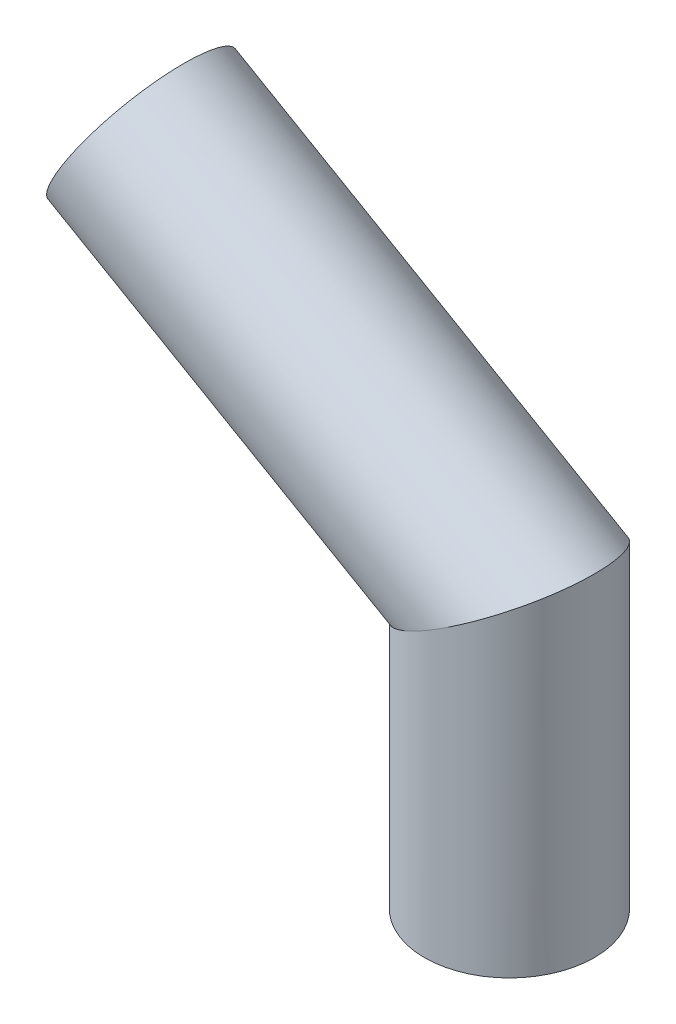
ISO-10303-21;
HEADER;
FILE_DESCRIPTION(('STEP AP214'),'2;1');
FILE_NAME('part.step','',(''),(''),'','','');
FILE_SCHEMA(('AUTOMOTIVE_DESIGN { 1 0 10303 214 1 1 1 1 }'));
ENDSEC;
DATA;
#1=APPLICATION_CONTEXT('core data for automotive mechanical design processes');
#2=APPLICATION_PROTOCOL_DEFINITION('international standard','automotive_design',2000,#1);
#3=PRODUCT_CONTEXT('',#1,'mechanical');
#4=PRODUCT('Part','Part','',(#3));
#5=PRODUCT_RELATED_PRODUCT_CATEGORY('part','',(#4));
#6=PRODUCT_DEFINITION_FORMATION('','',#4);
#7=PRODUCT_DEFINITION_CONTEXT('part definition',#1,'design');
#8=PRODUCT_DEFINITION('design','',#6,#7);
#9=PRODUCT_DEFINITION_SHAPE('','',#8);
#10=(LENGTH_UNIT() NAMED_UNIT(*) SI_UNIT(.MILLI.,.METRE.));
#11=(NAMED_UNIT(*) PLANE_ANGLE_UNIT() SI_UNIT($,.RADIAN.));
#12=(NAMED_UNIT(*) SI_UNIT($,.STERADIAN.) SOLID_ANGLE_UNIT());
#13=UNCERTAINTY_MEASURE_WITH_UNIT(LENGTH_MEASURE(1.E-05),#10,'distance_accuracy_value','');
#14=(GEOMETRIC_REPRESENTATION_CONTEXT(3) GLOBAL_UNCERTAINTY_ASSIGNED_CONTEXT((#13)) GLOBAL_UNIT_ASSIGNED_CONTEXT((#10,
#11,#12)) REPRESENTATION_CONTEXT('',''));
#15=CARTESIAN_POINT('',(0.,0.,0.));
#16=DIRECTION('',(0.,0.,1.));
#17=DIRECTION('',(1.,0.,0.));
#18=AXIS2_PLACEMENT_3D('',#15,#16,#17);
#19=CARTESIAN_POINT('',(1299.03810567666,-1750.,0.));
#20=DIRECTION('',(0.,1.,0.));
#21=DIRECTION('',(0.,0.,1.));
#22=AXIS2_PLACEMENT_3D('',#19,#20,#21);
#23=PLANE('',#22);
#24=CARTESIAN_POINT('',(1299.03810567666,-1750.,0.));
#25=DIRECTION('',(0.,1.,0.));
#26=DIRECTION('',(0.,0.,1.));
#27=AXIS2_PLACEMENT_3D('',#24,#25,#26);
#28=CIRCLE('',#27,299.977316583883);
#29=CARTESIAN_POINT('',(1299.03810567666,-1750.,299.977316583883));
#30=VERTEX_POINT('',#29);
#31=EDGE_CURVE('E36',#30,#30,#28,.T.);
#32=ORIENTED_EDGE('',*,*,#31,.F.);
#33=EDGE_LOOP('',(#32));
#34=FACE_BOUND('',#33,.T.);
#35=ADVANCED_FACE('F33',(#34),#23,.F.);
#36=CARTESIAN_POINT('',(0.,1.11022302462516E-13,0.));
#37=DIRECTION('',(-0.866025403784438,0.500000000000001,0.));
#38=DIRECTION('',(0.,0.,1.));
#39=AXIS2_PLACEMENT_3D('',#36,#37,#38);
#40=PLANE('',#39);
#41=CARTESIAN_POINT('',(0.,1.11022302462516E-13,0.));
#42=DIRECTION('',(-0.866025403784438,0.500000000000001,0.));
#43=DIRECTION('',(0.,0.,1.));
#44=AXIS2_PLACEMENT_3D('',#41,#42,#43);
#45=CIRCLE('',#44,299.977316583883);
#46=CARTESIAN_POINT('',(0.,1.11022302462516E-13,299.977316583883));
#47=VERTEX_POINT('',#46);
#48=EDGE_CURVE('E41',#47,#47,#45,.T.);
#49=ORIENTED_EDGE('',*,*,#48,.T.);
#50=EDGE_LOOP('',(#49));
#51=FACE_BOUND('',#50,.T.);
#52=ADVANCED_FACE('F57',(#51),#40,.T.);
#53=CARTESIAN_POINT('',(1299.03810567666,-368.877634142931,0.));
#54=DIRECTION('',(0.,-1.,0.));
#55=DIRECTION('',(0.,0.,-1.));
#56=AXIS2_PLACEMENT_3D('',#53,#54,#55);
#57=CYLINDRICAL_SURFACE('',#56,299.977316583883);
#58=CARTESIAN_POINT('',(1299.03810567666,-750.000000000002,0.));
#59=DIRECTION('',(0.5,-0.866025403784439,0.));
#60=DIRECTION('',(0.866025403784439,0.5,0.));
#61=AXIS2_PLACEMENT_3D('',#58,#59,#60);
#62=ELLIPSE('',#61,346.383968960973,299.977316583883);
#63=CARTESIAN_POINT('',(1599.01542226054,-576.808015519515,0.));
#64=VERTEX_POINT('',#63);
#65=EDGE_CURVE('E11',#64,#64,#62,.T.);
#66=ORIENTED_EDGE('',*,*,#65,.T.);
#67=EDGE_LOOP('',(#66));
#68=FACE_BOUND('',#67,.T.);
#69=ORIENTED_EDGE('',*,*,#31,.T.);
#70=EDGE_LOOP('',(#69));
#71=FACE_BOUND('',#70,.T.);
#72=ADVANCED_FACE('F55',(#68,#71),#57,.T.);
#73=CARTESIAN_POINT('',(0.,1.11022302462516E-13,0.));
#74=DIRECTION('',(0.866025403784438,-0.500000000000001,0.));
#75=DIRECTION('',(0.500000000000001,0.866025403784438,0.));
#76=AXIS2_PLACEMENT_3D('',#73,#74,#75);
#77=CYLINDRICAL_SURFACE('',#76,299.977316583883);
#78=ORIENTED_EDGE('',*,*,#48,.F.);
#79=EDGE_LOOP('',(#78));
#80=FACE_BOUND('',#79,.T.);
#81=ORIENTED_EDGE('',*,*,#65,.F.);
#82=EDGE_LOOP('',(#81));
#83=FACE_BOUND('',#82,.T.);
#84=ADVANCED_FACE('F53',(#80,#83),#77,.T.);
#85=CLOSED_SHELL('',(#35,#52,#72,#84));
#86=MANIFOLD_SOLID_BREP('B2',#85);
#87=ADVANCED_BREP_SHAPE_REPRESENTATION('',(#18,#86),#14);
#88=SHAPE_DEFINITION_REPRESENTATION(#9,#87);
ENDSEC;
END-ISO-10303-21;
